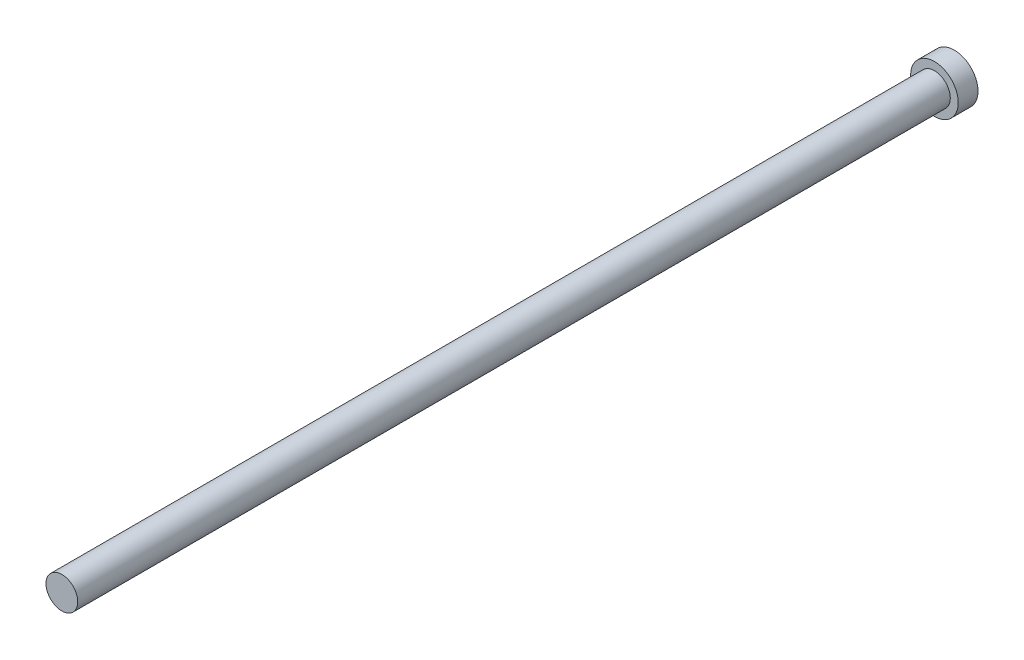
ISO-10303-21;
HEADER;
FILE_DESCRIPTION(('STEP AP214'),'2;1');
FILE_NAME('part.step','',(''),(''),'','','');
FILE_SCHEMA(('AUTOMOTIVE_DESIGN { 1 0 10303 214 1 1 1 1 }'));
ENDSEC;
DATA;
#1=APPLICATION_CONTEXT('core data for automotive mechanical design processes');
#2=APPLICATION_PROTOCOL_DEFINITION('international standard','automotive_design',2000,#1);
#3=PRODUCT_CONTEXT('',#1,'mechanical');
#4=PRODUCT('Part','Part','',(#3));
#5=PRODUCT_RELATED_PRODUCT_CATEGORY('part','',(#4));
#6=PRODUCT_DEFINITION_FORMATION('','',#4);
#7=PRODUCT_DEFINITION_CONTEXT('part definition',#1,'design');
#8=PRODUCT_DEFINITION('design','',#6,#7);
#9=PRODUCT_DEFINITION_SHAPE('','',#8);
#10=(LENGTH_UNIT() NAMED_UNIT(*) SI_UNIT(.MILLI.,.METRE.));
#11=(NAMED_UNIT(*) PLANE_ANGLE_UNIT() SI_UNIT($,.RADIAN.));
#12=(NAMED_UNIT(*) SI_UNIT($,.STERADIAN.) SOLID_ANGLE_UNIT());
#13=UNCERTAINTY_MEASURE_WITH_UNIT(LENGTH_MEASURE(1.E-05),#10,'distance_accuracy_value','');
#14=(GEOMETRIC_REPRESENTATION_CONTEXT(3) GLOBAL_UNCERTAINTY_ASSIGNED_CONTEXT((#13)) GLOBAL_UNIT_ASSIGNED_CONTEXT((#10,
#11,#12)) REPRESENTATION_CONTEXT('',''));
#15=CARTESIAN_POINT('',(0.,0.,0.));
#16=DIRECTION('',(0.,0.,1.));
#17=DIRECTION('',(1.,0.,0.));
#18=AXIS2_PLACEMENT_3D('',#15,#16,#17);
#19=CARTESIAN_POINT('',(0.,0.,55.88));
#20=DIRECTION('',(0.,0.,-1.));
#21=DIRECTION('',(-1.,0.,0.));
#22=AXIS2_PLACEMENT_3D('',#19,#20,#21);
#23=CYLINDRICAL_SURFACE('',#22,1.016);
#24=CARTESIAN_POINT('',(0.,0.,55.88));
#25=DIRECTION('',(0.,0.,1.));
#26=DIRECTION('',(1.,0.,0.));
#27=AXIS2_PLACEMENT_3D('',#24,#25,#26);
#28=CIRCLE('',#27,1.016);
#29=CARTESIAN_POINT('',(1.016,0.,55.88));
#30=VERTEX_POINT('',#29);
#31=EDGE_CURVE('E10',#30,#30,#28,.T.);
#32=ORIENTED_EDGE('',*,*,#31,.F.);
#33=EDGE_LOOP('',(#32));
#34=FACE_BOUND('',#33,.T.);
#35=CARTESIAN_POINT('',(0.,0.,0.));
#36=DIRECTION('',(0.,0.,-1.));
#37=DIRECTION('',(-1.,0.,0.));
#38=AXIS2_PLACEMENT_3D('',#35,#36,#37);
#39=CIRCLE('',#38,1.016);
#40=CARTESIAN_POINT('',(-1.016,0.,0.));
#41=VERTEX_POINT('',#40);
#42=EDGE_CURVE('E37',#41,#41,#39,.T.);
#43=ORIENTED_EDGE('',*,*,#42,.F.);
#44=EDGE_LOOP('',(#43));
#45=FACE_BOUND('',#44,.T.);
#46=ADVANCED_FACE('F31',(#34,#45),#23,.T.);
#47=CARTESIAN_POINT('',(0.,0.,55.88));
#48=DIRECTION('',(0.,0.,1.));
#49=DIRECTION('',(1.,0.,0.));
#50=AXIS2_PLACEMENT_3D('',#47,#48,#49);
#51=PLANE('',#50);
#52=ORIENTED_EDGE('',*,*,#31,.T.);
#53=EDGE_LOOP('',(#52));
#54=FACE_BOUND('',#53,.T.);
#55=ADVANCED_FACE('F55',(#54),#51,.T.);
#56=CARTESIAN_POINT('',(0.,0.,0.));
#57=DIRECTION('',(0.,0.,-1.));
#58=DIRECTION('',(-1.,0.,0.));
#59=AXIS2_PLACEMENT_3D('',#56,#57,#58);
#60=PLANE('',#59);
#61=CARTESIAN_POINT('',(0.,0.,0.));
#62=DIRECTION('',(0.,0.,-1.));
#63=DIRECTION('',(-1.,0.,0.));
#64=AXIS2_PLACEMENT_3D('',#61,#62,#63);
#65=CIRCLE('',#64,1.524);
#66=CARTESIAN_POINT('',(-1.524,0.,0.));
#67=VERTEX_POINT('',#66);
#68=EDGE_CURVE('E45',#67,#67,#65,.T.);
#69=ORIENTED_EDGE('',*,*,#68,.F.);
#70=EDGE_LOOP('',(#69));
#71=FACE_BOUND('',#70,.T.);
#72=ORIENTED_EDGE('',*,*,#42,.T.);
#73=EDGE_LOOP('',(#72));
#74=FACE_BOUND('',#73,.T.);
#75=ADVANCED_FACE('F53',(#71,#74),#60,.F.);
#76=CARTESIAN_POINT('',(0.,0.,-1.27));
#77=DIRECTION('',(0.,0.,1.));
#78=DIRECTION('',(1.,0.,0.));
#79=AXIS2_PLACEMENT_3D('',#76,#77,#78);
#80=CYLINDRICAL_SURFACE('',#79,1.524);
#81=CARTESIAN_POINT('',(0.,0.,-1.27));
#82=DIRECTION('',(0.,0.,-1.));
#83=DIRECTION('',(-1.,0.,0.));
#84=AXIS2_PLACEMENT_3D('',#81,#82,#83);
#85=CIRCLE('',#84,1.524);
#86=CARTESIAN_POINT('',(-1.524,0.,-1.27));
#87=VERTEX_POINT('',#86);
#88=EDGE_CURVE('E41',#87,#87,#85,.T.);
#89=ORIENTED_EDGE('',*,*,#88,.F.);
#90=EDGE_LOOP('',(#89));
#91=FACE_BOUND('',#90,.T.);
#92=ORIENTED_EDGE('',*,*,#68,.T.);
#93=EDGE_LOOP('',(#92));
#94=FACE_BOUND('',#93,.T.);
#95=ADVANCED_FACE('F51',(#91,#94),#80,.T.);
#96=CARTESIAN_POINT('',(0.,0.,-1.27));
#97=DIRECTION('',(0.,0.,-1.));
#98=DIRECTION('',(-1.,0.,0.));
#99=AXIS2_PLACEMENT_3D('',#96,#97,#98);
#100=PLANE('',#99);
#101=ORIENTED_EDGE('',*,*,#88,.T.);
#102=EDGE_LOOP('',(#101));
#103=FACE_BOUND('',#102,.T.);
#104=ADVANCED_FACE('F61',(#103),#100,.T.);
#105=CLOSED_SHELL('',(#46,#55,#75,#95,#104));
#106=MANIFOLD_SOLID_BREP('B2',#105);
#107=ADVANCED_BREP_SHAPE_REPRESENTATION('',(#18,#106),#14);
#108=SHAPE_DEFINITION_REPRESENTATION(#9,#107);
ENDSEC;
END-ISO-10303-21;
